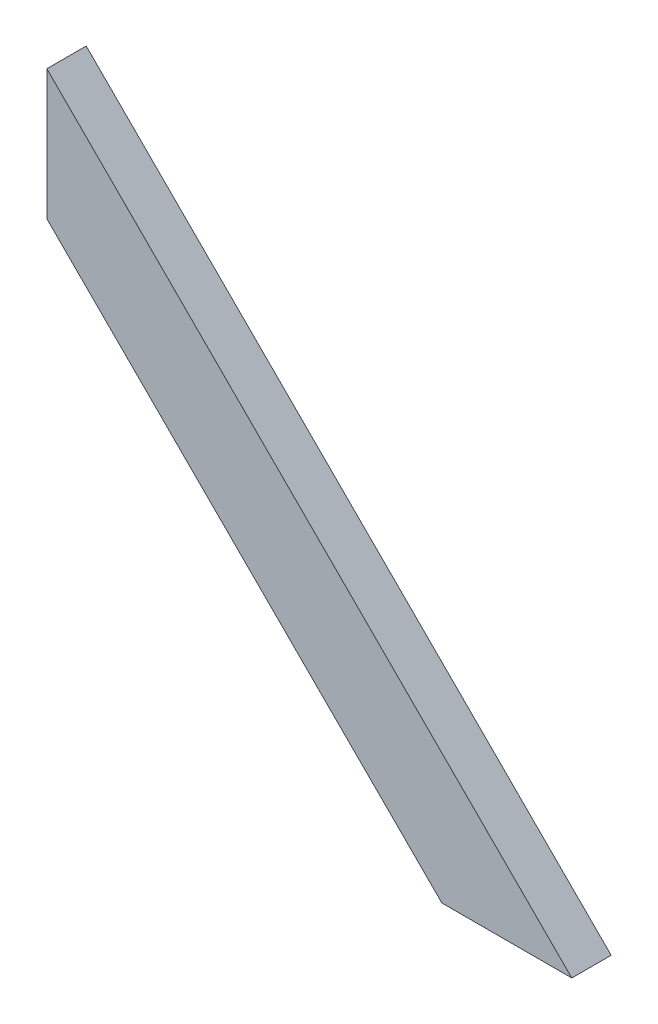
ISO-10303-21;
HEADER;
FILE_DESCRIPTION(('STEP AP214'),'2;1');
FILE_NAME('part.step','',(''),(''),'','','');
FILE_SCHEMA(('AUTOMOTIVE_DESIGN { 1 0 10303 214 1 1 1 1 }'));
ENDSEC;
DATA;
#1=APPLICATION_CONTEXT('core data for automotive mechanical design processes');
#2=APPLICATION_PROTOCOL_DEFINITION('international standard','automotive_design',2000,#1);
#3=PRODUCT_CONTEXT('',#1,'mechanical');
#4=PRODUCT('Part','Part','',(#3));
#5=PRODUCT_RELATED_PRODUCT_CATEGORY('part','',(#4));
#6=PRODUCT_DEFINITION_FORMATION('','',#4);
#7=PRODUCT_DEFINITION_CONTEXT('part definition',#1,'design');
#8=PRODUCT_DEFINITION('design','',#6,#7);
#9=PRODUCT_DEFINITION_SHAPE('','',#8);
#10=(LENGTH_UNIT() NAMED_UNIT(*) SI_UNIT(.MILLI.,.METRE.));
#11=(NAMED_UNIT(*) PLANE_ANGLE_UNIT() SI_UNIT($,.RADIAN.));
#12=(NAMED_UNIT(*) SI_UNIT($,.STERADIAN.) SOLID_ANGLE_UNIT());
#13=UNCERTAINTY_MEASURE_WITH_UNIT(LENGTH_MEASURE(1.E-05),#10,'distance_accuracy_value','');
#14=(GEOMETRIC_REPRESENTATION_CONTEXT(3) GLOBAL_UNCERTAINTY_ASSIGNED_CONTEXT((#13)) GLOBAL_UNIT_ASSIGNED_CONTEXT((#10,
#11,#12)) REPRESENTATION_CONTEXT('',''));
#15=CARTESIAN_POINT('',(0.,0.,0.));
#16=DIRECTION('',(0.,0.,1.));
#17=DIRECTION('',(1.,0.,0.));
#18=AXIS2_PLACEMENT_3D('',#15,#16,#17);
#19=CARTESIAN_POINT('',(-140.62660944206,473.115879828326,38.1));
#20=DIRECTION('',(1.,0.,0.));
#21=DIRECTION('',(0.,0.,-1.));
#22=AXIS2_PLACEMENT_3D('',#19,#20,#21);
#23=PLANE('',#22);
#24=DIRECTION('',(0.,-1.,0.));
#25=VECTOR('',#24,1.);
#26=CARTESIAN_POINT('',(-140.62660944206,473.115879828326,0.));
#27=LINE('',#26,#25);
#28=CARTESIAN_POINT('',(-140.62660944206,473.115879828326,0.));
#29=VERTEX_POINT('',#28);
#30=CARTESIAN_POINT('',(-140.62660944206,347.392294133358,0.));
#31=VERTEX_POINT('',#30);
#32=EDGE_CURVE('E95',#29,#31,#27,.T.);
#33=ORIENTED_EDGE('',*,*,#32,.T.);
#34=DIRECTION('',(0.,0.,-1.));
#35=VECTOR('',#34,1.);
#36=CARTESIAN_POINT('',(-140.62660944206,347.392294133358,38.1));
#37=LINE('',#36,#35);
#38=CARTESIAN_POINT('',(-140.62660944206,347.392294133358,38.1));
#39=VERTEX_POINT('',#38);
#40=EDGE_CURVE('E11',#39,#31,#37,.T.);
#41=ORIENTED_EDGE('',*,*,#40,.F.);
#42=DIRECTION('',(0.,-1.,0.));
#43=VECTOR('',#42,1.);
#44=CARTESIAN_POINT('',(-140.62660944206,473.115879828326,38.1));
#45=LINE('',#44,#43);
#46=CARTESIAN_POINT('',(-140.62660944206,473.115879828326,38.1));
#47=VERTEX_POINT('',#46);
#48=EDGE_CURVE('E83',#47,#39,#45,.T.);
#49=ORIENTED_EDGE('',*,*,#48,.F.);
#50=DIRECTION('',(0.,0.,-1.));
#51=VECTOR('',#50,1.);
#52=CARTESIAN_POINT('',(-140.62660944206,473.115879828326,38.1));
#53=LINE('',#52,#51);
#54=EDGE_CURVE('E91',#47,#29,#53,.T.);
#55=ORIENTED_EDGE('',*,*,#54,.T.);
#56=EDGE_LOOP('',(#33,#41,#49,#55));
#57=FACE_BOUND('',#56,.T.);
#58=ADVANCED_FACE('F32',(#57),#23,.F.);
#59=CARTESIAN_POINT('',(-140.62660944206,347.392294133358,38.1));
#60=DIRECTION('',(0.707106781186548,0.707106781186547,0.));
#61=DIRECTION('',(-0.707106781186547,0.707106781186548,0.));
#62=AXIS2_PLACEMENT_3D('',#59,#60,#61);
#63=PLANE('',#62);
#64=DIRECTION('',(0.707106781186547,-0.707106781186548,0.));
#65=VECTOR('',#64,1.);
#66=CARTESIAN_POINT('',(-140.62660944206,347.392294133358,0.));
#67=LINE('',#66,#65);
#68=CARTESIAN_POINT('',(241.649804862972,-34.8841201716738,0.));
#69=VERTEX_POINT('',#68);
#70=EDGE_CURVE('E87',#31,#69,#67,.T.);
#71=ORIENTED_EDGE('',*,*,#70,.T.);
#72=DIRECTION('',(0.,0.,-1.));
#73=VECTOR('',#72,1.);
#74=CARTESIAN_POINT('',(241.649804862972,-34.8841201716738,38.1));
#75=LINE('',#74,#73);
#76=CARTESIAN_POINT('',(241.649804862972,-34.8841201716738,38.1));
#77=VERTEX_POINT('',#76);
#78=EDGE_CURVE('E40',#77,#69,#75,.T.);
#79=ORIENTED_EDGE('',*,*,#78,.F.);
#80=DIRECTION('',(0.707106781186547,-0.707106781186548,0.));
#81=VECTOR('',#80,1.);
#82=CARTESIAN_POINT('',(-140.62660944206,347.392294133358,38.1));
#83=LINE('',#82,#81);
#84=EDGE_CURVE('E78',#39,#77,#83,.T.);
#85=ORIENTED_EDGE('',*,*,#84,.F.);
#86=ORIENTED_EDGE('',*,*,#40,.T.);
#87=EDGE_LOOP('',(#71,#79,#85,#86));
#88=FACE_BOUND('',#87,.T.);
#89=ADVANCED_FACE('F86',(#88),#63,.F.);
#90=CARTESIAN_POINT('',(241.649804862972,-34.8841201716738,38.1));
#91=DIRECTION('',(0.,1.,0.));
#92=DIRECTION('',(0.,0.,1.));
#93=AXIS2_PLACEMENT_3D('',#90,#91,#92);
#94=PLANE('',#93);
#95=DIRECTION('',(1.,0.,0.));
#96=VECTOR('',#95,1.);
#97=CARTESIAN_POINT('',(241.649804862972,-34.8841201716738,0.));
#98=LINE('',#97,#96);
#99=CARTESIAN_POINT('',(367.37339055794,-34.8841201716738,0.));
#100=VERTEX_POINT('',#99);
#101=EDGE_CURVE('E65',#69,#100,#98,.T.);
#102=ORIENTED_EDGE('',*,*,#101,.T.);
#103=DIRECTION('',(0.,0.,-1.));
#104=VECTOR('',#103,1.);
#105=CARTESIAN_POINT('',(367.37339055794,-34.8841201716738,38.1));
#106=LINE('',#105,#104);
#107=CARTESIAN_POINT('',(367.37339055794,-34.8841201716738,38.1));
#108=VERTEX_POINT('',#107);
#109=EDGE_CURVE('E88',#108,#100,#106,.T.);
#110=ORIENTED_EDGE('',*,*,#109,.F.);
#111=DIRECTION('',(1.,0.,0.));
#112=VECTOR('',#111,1.);
#113=CARTESIAN_POINT('',(241.649804862972,-34.8841201716738,38.1));
#114=LINE('',#113,#112);
#115=EDGE_CURVE('E81',#77,#108,#114,.T.);
#116=ORIENTED_EDGE('',*,*,#115,.F.);
#117=ORIENTED_EDGE('',*,*,#78,.T.);
#118=EDGE_LOOP('',(#102,#110,#116,#117));
#119=FACE_BOUND('',#118,.T.);
#120=ADVANCED_FACE('F89',(#119),#94,.F.);
#121=CARTESIAN_POINT('',(367.37339055794,-34.8841201716738,38.1));
#122=DIRECTION('',(-0.707106781186548,-0.707106781186548,0.));
#123=DIRECTION('',(0.707106781186548,-0.707106781186548,0.));
#124=AXIS2_PLACEMENT_3D('',#121,#122,#123);
#125=PLANE('',#124);
#126=DIRECTION('',(-0.707106781186548,0.707106781186548,0.));
#127=VECTOR('',#126,1.);
#128=CARTESIAN_POINT('',(367.37339055794,-34.8841201716738,0.));
#129=LINE('',#128,#127);
#130=EDGE_CURVE('E71',#100,#29,#129,.T.);
#131=ORIENTED_EDGE('',*,*,#130,.T.);
#132=ORIENTED_EDGE('',*,*,#54,.F.);
#133=DIRECTION('',(-0.707106781186548,0.707106781186548,0.));
#134=VECTOR('',#133,1.);
#135=CARTESIAN_POINT('',(367.37339055794,-34.8841201716738,38.1));
#136=LINE('',#135,#134);
#137=EDGE_CURVE('E48',#108,#47,#136,.T.);
#138=ORIENTED_EDGE('',*,*,#137,.F.);
#139=ORIENTED_EDGE('',*,*,#109,.T.);
#140=EDGE_LOOP('',(#131,#132,#138,#139));
#141=FACE_BOUND('',#140,.T.);
#142=ADVANCED_FACE('F102',(#141),#125,.F.);
#143=CARTESIAN_POINT('',(0.,0.,38.1));
#144=DIRECTION('',(0.,0.,1.));
#145=DIRECTION('',(1.,0.,0.));
#146=AXIS2_PLACEMENT_3D('',#143,#144,#145);
#147=PLANE('',#146);
#148=ORIENTED_EDGE('',*,*,#48,.T.);
#149=ORIENTED_EDGE('',*,*,#84,.T.);
#150=ORIENTED_EDGE('',*,*,#115,.T.);
#151=ORIENTED_EDGE('',*,*,#137,.T.);
#152=EDGE_LOOP('',(#148,#149,#150,#151));
#153=FACE_BOUND('',#152,.T.);
#154=ADVANCED_FACE('F79',(#153),#147,.T.);
#155=CARTESIAN_POINT('',(0.,0.,0.));
#156=DIRECTION('',(0.,0.,1.));
#157=DIRECTION('',(1.,0.,0.));
#158=AXIS2_PLACEMENT_3D('',#155,#156,#157);
#159=PLANE('',#158);
#160=ORIENTED_EDGE('',*,*,#32,.F.);
#161=ORIENTED_EDGE('',*,*,#130,.F.);
#162=ORIENTED_EDGE('',*,*,#101,.F.);
#163=ORIENTED_EDGE('',*,*,#70,.F.);
#164=EDGE_LOOP('',(#160,#161,#162,#163));
#165=FACE_BOUND('',#164,.T.);
#166=ADVANCED_FACE('F105',(#165),#159,.F.);
#167=CLOSED_SHELL('',(#58,#89,#120,#142,#154,#166));
#168=MANIFOLD_SOLID_BREP('B2',#167);
#169=ADVANCED_BREP_SHAPE_REPRESENTATION('',(#18,#168),#14);
#170=SHAPE_DEFINITION_REPRESENTATION(#9,#169);
ENDSEC;
END-ISO-10303-21;
